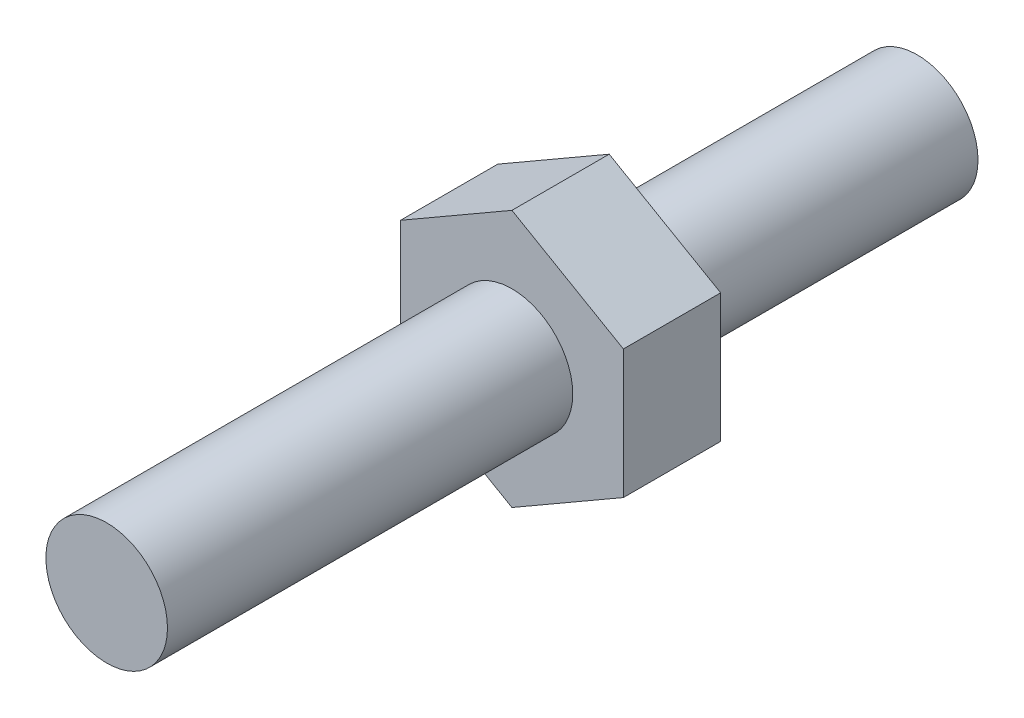
ISO-10303-21;
HEADER;
FILE_DESCRIPTION(('STEP AP214'),'2;1');
FILE_NAME('part.step','',(''),(''),'','','');
FILE_SCHEMA(('AUTOMOTIVE_DESIGN { 1 0 10303 214 1 1 1 1 }'));
ENDSEC;
DATA;
#1=APPLICATION_CONTEXT('core data for automotive mechanical design processes');
#2=APPLICATION_PROTOCOL_DEFINITION('international standard','automotive_design',2000,#1);
#3=PRODUCT_CONTEXT('',#1,'mechanical');
#4=PRODUCT('Part','Part','',(#3));
#5=PRODUCT_RELATED_PRODUCT_CATEGORY('part','',(#4));
#6=PRODUCT_DEFINITION_FORMATION('','',#4);
#7=PRODUCT_DEFINITION_CONTEXT('part definition',#1,'design');
#8=PRODUCT_DEFINITION('design','',#6,#7);
#9=PRODUCT_DEFINITION_SHAPE('','',#8);
#10=(LENGTH_UNIT() NAMED_UNIT(*) SI_UNIT(.MILLI.,.METRE.));
#11=(NAMED_UNIT(*) PLANE_ANGLE_UNIT() SI_UNIT($,.RADIAN.));
#12=(NAMED_UNIT(*) SI_UNIT($,.STERADIAN.) SOLID_ANGLE_UNIT());
#13=UNCERTAINTY_MEASURE_WITH_UNIT(LENGTH_MEASURE(1.E-05),#10,'distance_accuracy_value','');
#14=(GEOMETRIC_REPRESENTATION_CONTEXT(3) GLOBAL_UNCERTAINTY_ASSIGNED_CONTEXT((#13)) GLOBAL_UNIT_ASSIGNED_CONTEXT((#10,
#11,#12)) REPRESENTATION_CONTEXT('',''));
#15=CARTESIAN_POINT('',(0.,0.,0.));
#16=DIRECTION('',(0.,0.,1.));
#17=DIRECTION('',(1.,0.,0.));
#18=AXIS2_PLACEMENT_3D('',#15,#16,#17);
#19=CARTESIAN_POINT('',(0.,0.,-10.));
#20=DIRECTION('',(0.,0.,1.));
#21=DIRECTION('',(1.,0.,0.));
#22=AXIS2_PLACEMENT_3D('',#19,#20,#21);
#23=CYLINDRICAL_SURFACE('',#22,1.5);
#24=CARTESIAN_POINT('',(0.,0.,-2.4));
#25=DIRECTION('',(0.,0.,-1.));
#26=DIRECTION('',(-1.,0.,0.));
#27=AXIS2_PLACEMENT_3D('',#24,#25,#26);
#28=CIRCLE('',#27,1.5);
#29=CARTESIAN_POINT('',(-1.5,0.,-2.4));
#30=VERTEX_POINT('',#29);
#31=EDGE_CURVE('E183',#30,#30,#28,.T.);
#32=ORIENTED_EDGE('',*,*,#31,.T.);
#33=EDGE_LOOP('',(#32));
#34=FACE_BOUND('',#33,.T.);
#35=CARTESIAN_POINT('',(0.,0.,-10.));
#36=DIRECTION('',(0.,0.,1.));
#37=DIRECTION('',(1.,0.,0.));
#38=AXIS2_PLACEMENT_3D('',#35,#36,#37);
#39=CIRCLE('',#38,1.5);
#40=CARTESIAN_POINT('',(1.5,0.,-10.));
#41=VERTEX_POINT('',#40);
#42=EDGE_CURVE('E180',#41,#41,#39,.T.);
#43=ORIENTED_EDGE('',*,*,#42,.T.);
#44=EDGE_LOOP('',(#43));
#45=FACE_BOUND('',#44,.T.);
#46=ADVANCED_FACE('F35',(#34,#45),#23,.T.);
#47=CARTESIAN_POINT('',(0.,0.,-10.));
#48=DIRECTION('',(0.,0.,1.));
#49=DIRECTION('',(1.,0.,0.));
#50=AXIS2_PLACEMENT_3D('',#47,#48,#49);
#51=PLANE('',#50);
#52=ORIENTED_EDGE('',*,*,#42,.F.);
#53=EDGE_LOOP('',(#52));
#54=FACE_BOUND('',#53,.T.);
#55=ADVANCED_FACE('F152',(#54),#51,.F.);
#56=CARTESIAN_POINT('',(0.,3.17542648054296,-2.4));
#57=DIRECTION('',(-0.500000000000008,0.866025403784434,0.));
#58=DIRECTION('',(-0.866025403784434,-0.500000000000008,0.));
#59=AXIS2_PLACEMENT_3D('',#56,#57,#58);
#60=PLANE('',#59);
#61=DIRECTION('',(-0.866025403784434,-0.500000000000008,0.));
#62=VECTOR('',#61,1.);
#63=CARTESIAN_POINT('',(0.,3.17542648054296,0.));
#64=LINE('',#63,#62);
#65=CARTESIAN_POINT('',(0.,3.17542648054296,0.));
#66=VERTEX_POINT('',#65);
#67=CARTESIAN_POINT('',(-2.75,1.58771324027145,0.));
#68=VERTEX_POINT('',#67);
#69=EDGE_CURVE('E121',#66,#68,#64,.T.);
#70=ORIENTED_EDGE('',*,*,#69,.F.);
#71=DIRECTION('',(0.,0.,1.));
#72=VECTOR('',#71,1.);
#73=CARTESIAN_POINT('',(0.,3.17542648054296,-2.4));
#74=LINE('',#73,#72);
#75=CARTESIAN_POINT('',(0.,3.17542648054296,-2.4));
#76=VERTEX_POINT('',#75);
#77=EDGE_CURVE('E11',#76,#66,#74,.T.);
#78=ORIENTED_EDGE('',*,*,#77,.F.);
#79=DIRECTION('',(-0.866025403784434,-0.500000000000008,0.));
#80=VECTOR('',#79,1.);
#81=CARTESIAN_POINT('',(0.,3.17542648054296,-2.4));
#82=LINE('',#81,#80);
#83=CARTESIAN_POINT('',(-2.75,1.58771324027145,-2.4));
#84=VERTEX_POINT('',#83);
#85=EDGE_CURVE('E136',#76,#84,#82,.T.);
#86=ORIENTED_EDGE('',*,*,#85,.T.);
#87=DIRECTION('',(0.,0.,1.));
#88=VECTOR('',#87,1.);
#89=CARTESIAN_POINT('',(-2.75,1.58771324027145,-2.4));
#90=LINE('',#89,#88);
#91=EDGE_CURVE('E39',#84,#68,#90,.T.);
#92=ORIENTED_EDGE('',*,*,#91,.T.);
#93=EDGE_LOOP('',(#70,#78,#86,#92));
#94=FACE_BOUND('',#93,.T.);
#95=ADVANCED_FACE('F37',(#94),#60,.T.);
#96=CARTESIAN_POINT('',(2.75,1.58771324027146,-2.4));
#97=DIRECTION('',(0.500000000000008,0.866025403784434,0.));
#98=DIRECTION('',(-0.866025403784434,0.500000000000008,0.));
#99=AXIS2_PLACEMENT_3D('',#96,#97,#98);
#100=PLANE('',#99);
#101=DIRECTION('',(-0.866025403784434,0.500000000000008,0.));
#102=VECTOR('',#101,1.);
#103=CARTESIAN_POINT('',(2.75,1.58771324027146,0.));
#104=LINE('',#103,#102);
#105=CARTESIAN_POINT('',(2.75,1.58771324027146,0.));
#106=VERTEX_POINT('',#105);
#107=EDGE_CURVE('E134',#106,#66,#104,.T.);
#108=ORIENTED_EDGE('',*,*,#107,.F.);
#109=DIRECTION('',(0.,0.,1.));
#110=VECTOR('',#109,1.);
#111=CARTESIAN_POINT('',(2.75,1.58771324027146,-2.4));
#112=LINE('',#111,#110);
#113=CARTESIAN_POINT('',(2.75,1.58771324027146,-2.4));
#114=VERTEX_POINT('',#113);
#115=EDGE_CURVE('E45',#114,#106,#112,.T.);
#116=ORIENTED_EDGE('',*,*,#115,.F.);
#117=DIRECTION('',(-0.866025403784434,0.500000000000008,0.));
#118=VECTOR('',#117,1.);
#119=CARTESIAN_POINT('',(2.75,1.58771324027146,-2.4));
#120=LINE('',#119,#118);
#121=EDGE_CURVE('E103',#114,#76,#120,.T.);
#122=ORIENTED_EDGE('',*,*,#121,.T.);
#123=ORIENTED_EDGE('',*,*,#77,.T.);
#124=EDGE_LOOP('',(#108,#116,#122,#123));
#125=FACE_BOUND('',#124,.T.);
#126=ADVANCED_FACE('F144',(#125),#100,.T.);
#127=CARTESIAN_POINT('',(2.75,1.58771324027146,-2.4));
#128=DIRECTION('',(-1.,0.,0.));
#129=DIRECTION('',(0.,0.,1.));
#130=AXIS2_PLACEMENT_3D('',#127,#128,#129);
#131=PLANE('',#130);
#132=DIRECTION('',(0.,-1.,0.));
#133=VECTOR('',#132,1.);
#134=CARTESIAN_POINT('',(2.75,1.58771324027146,0.));
#135=LINE('',#134,#133);
#136=CARTESIAN_POINT('',(2.75,-1.5877132402715,0.));
#137=VERTEX_POINT('',#136);
#138=EDGE_CURVE('E107',#106,#137,#135,.T.);
#139=ORIENTED_EDGE('',*,*,#138,.T.);
#140=DIRECTION('',(0.,0.,1.));
#141=VECTOR('',#140,1.);
#142=CARTESIAN_POINT('',(2.75,-1.5877132402715,-2.4));
#143=LINE('',#142,#141);
#144=CARTESIAN_POINT('',(2.75,-1.5877132402715,-2.4));
#145=VERTEX_POINT('',#144);
#146=EDGE_CURVE('E105',#145,#137,#143,.T.);
#147=ORIENTED_EDGE('',*,*,#146,.F.);
#148=DIRECTION('',(0.,-1.,0.));
#149=VECTOR('',#148,1.);
#150=CARTESIAN_POINT('',(2.75,1.58771324027146,-2.4));
#151=LINE('',#150,#149);
#152=EDGE_CURVE('E96',#114,#145,#151,.T.);
#153=ORIENTED_EDGE('',*,*,#152,.F.);
#154=ORIENTED_EDGE('',*,*,#115,.T.);
#155=EDGE_LOOP('',(#139,#147,#153,#154));
#156=FACE_BOUND('',#155,.T.);
#157=ADVANCED_FACE('F106',(#156),#131,.F.);
#158=CARTESIAN_POINT('',(0.,-3.175426480543,-2.4));
#159=DIRECTION('',(0.500000000000007,-0.866025403784435,0.));
#160=DIRECTION('',(0.866025403784435,0.500000000000007,0.));
#161=AXIS2_PLACEMENT_3D('',#158,#159,#160);
#162=PLANE('',#161);
#163=DIRECTION('',(0.866025403784435,0.500000000000007,0.));
#164=VECTOR('',#163,1.);
#165=CARTESIAN_POINT('',(0.,-3.175426480543,0.));
#166=LINE('',#165,#164);
#167=CARTESIAN_POINT('',(0.,-3.175426480543,0.));
#168=VERTEX_POINT('',#167);
#169=EDGE_CURVE('E131',#168,#137,#166,.T.);
#170=ORIENTED_EDGE('',*,*,#169,.F.);
#171=DIRECTION('',(0.,0.,1.));
#172=VECTOR('',#171,1.);
#173=CARTESIAN_POINT('',(0.,-3.175426480543,-2.4));
#174=LINE('',#173,#172);
#175=CARTESIAN_POINT('',(0.,-3.175426480543,-2.4));
#176=VERTEX_POINT('',#175);
#177=EDGE_CURVE('E111',#176,#168,#174,.T.);
#178=ORIENTED_EDGE('',*,*,#177,.F.);
#179=DIRECTION('',(0.866025403784435,0.500000000000007,0.));
#180=VECTOR('',#179,1.);
#181=CARTESIAN_POINT('',(0.,-3.175426480543,-2.4));
#182=LINE('',#181,#180);
#183=EDGE_CURVE('E101',#176,#145,#182,.T.);
#184=ORIENTED_EDGE('',*,*,#183,.T.);
#185=ORIENTED_EDGE('',*,*,#146,.T.);
#186=EDGE_LOOP('',(#170,#178,#184,#185));
#187=FACE_BOUND('',#186,.T.);
#188=ADVANCED_FACE('F113',(#187),#162,.T.);
#189=CARTESIAN_POINT('',(-2.75,-1.5877132402715,-2.4));
#190=DIRECTION('',(-0.500000000000006,-0.866025403784435,0.));
#191=DIRECTION('',(0.866025403784435,-0.500000000000006,0.));
#192=AXIS2_PLACEMENT_3D('',#189,#190,#191);
#193=PLANE('',#192);
#194=DIRECTION('',(0.866025403784435,-0.500000000000006,0.));
#195=VECTOR('',#194,1.);
#196=CARTESIAN_POINT('',(-2.75,-1.5877132402715,0.));
#197=LINE('',#196,#195);
#198=CARTESIAN_POINT('',(-2.75,-1.5877132402715,0.));
#199=VERTEX_POINT('',#198);
#200=EDGE_CURVE('E128',#199,#168,#197,.T.);
#201=ORIENTED_EDGE('',*,*,#200,.F.);
#202=DIRECTION('',(0.,0.,1.));
#203=VECTOR('',#202,1.);
#204=CARTESIAN_POINT('',(-2.75,-1.5877132402715,-2.4));
#205=LINE('',#204,#203);
#206=CARTESIAN_POINT('',(-2.75,-1.5877132402715,-2.4));
#207=VERTEX_POINT('',#206);
#208=EDGE_CURVE('E139',#207,#199,#205,.T.);
#209=ORIENTED_EDGE('',*,*,#208,.F.);
#210=DIRECTION('',(0.866025403784435,-0.500000000000006,0.));
#211=VECTOR('',#210,1.);
#212=CARTESIAN_POINT('',(-2.75,-1.5877132402715,-2.4));
#213=LINE('',#212,#211);
#214=EDGE_CURVE('E114',#207,#176,#213,.T.);
#215=ORIENTED_EDGE('',*,*,#214,.T.);
#216=ORIENTED_EDGE('',*,*,#177,.T.);
#217=EDGE_LOOP('',(#201,#209,#215,#216));
#218=FACE_BOUND('',#217,.T.);
#219=ADVANCED_FACE('F189',(#218),#193,.T.);
#220=CARTESIAN_POINT('',(-2.75,1.58771324027145,-2.4));
#221=DIRECTION('',(-1.,0.,0.));
#222=DIRECTION('',(0.,0.,1.));
#223=AXIS2_PLACEMENT_3D('',#220,#221,#222);
#224=PLANE('',#223);
#225=DIRECTION('',(0.,-1.,0.));
#226=VECTOR('',#225,1.);
#227=CARTESIAN_POINT('',(-2.75,1.58771324027145,0.));
#228=LINE('',#227,#226);
#229=EDGE_CURVE('E124',#68,#199,#228,.T.);
#230=ORIENTED_EDGE('',*,*,#229,.F.);
#231=ORIENTED_EDGE('',*,*,#91,.F.);
#232=DIRECTION('',(0.,-1.,0.));
#233=VECTOR('',#232,1.);
#234=CARTESIAN_POINT('',(-2.75,1.58771324027145,-2.4));
#235=LINE('',#234,#233);
#236=EDGE_CURVE('E116',#84,#207,#235,.T.);
#237=ORIENTED_EDGE('',*,*,#236,.T.);
#238=ORIENTED_EDGE('',*,*,#208,.T.);
#239=EDGE_LOOP('',(#230,#231,#237,#238));
#240=FACE_BOUND('',#239,.T.);
#241=ADVANCED_FACE('F141',(#240),#224,.T.);
#242=CARTESIAN_POINT('',(0.,3.17542648054296,-2.4));
#243=DIRECTION('',(0.,0.,-1.));
#244=DIRECTION('',(-1.,0.,0.));
#245=AXIS2_PLACEMENT_3D('',#242,#243,#244);
#246=PLANE('',#245);
#247=ORIENTED_EDGE('',*,*,#31,.F.);
#248=EDGE_LOOP('',(#247));
#249=FACE_BOUND('',#248,.T.);
#250=ORIENTED_EDGE('',*,*,#85,.F.);
#251=ORIENTED_EDGE('',*,*,#121,.F.);
#252=ORIENTED_EDGE('',*,*,#152,.T.);
#253=ORIENTED_EDGE('',*,*,#183,.F.);
#254=ORIENTED_EDGE('',*,*,#214,.F.);
#255=ORIENTED_EDGE('',*,*,#236,.F.);
#256=EDGE_LOOP('',(#250,#251,#252,#253,#254,#255));
#257=FACE_BOUND('',#256,.T.);
#258=ADVANCED_FACE('F98',(#249,#257),#246,.T.);
#259=CARTESIAN_POINT('',(0.,3.17542648054296,0.));
#260=DIRECTION('',(0.,0.,-1.));
#261=DIRECTION('',(-1.,0.,0.));
#262=AXIS2_PLACEMENT_3D('',#259,#260,#261);
#263=PLANE('',#262);
#264=CARTESIAN_POINT('',(0.,0.,0.));
#265=DIRECTION('',(0.,0.,1.));
#266=DIRECTION('',(1.,0.,0.));
#267=AXIS2_PLACEMENT_3D('',#264,#265,#266);
#268=CIRCLE('',#267,1.5);
#269=CARTESIAN_POINT('',(1.5,0.,0.));
#270=VERTEX_POINT('',#269);
#271=EDGE_CURVE('E125',#270,#270,#268,.T.);
#272=ORIENTED_EDGE('',*,*,#271,.F.);
#273=EDGE_LOOP('',(#272));
#274=FACE_BOUND('',#273,.T.);
#275=ORIENTED_EDGE('',*,*,#69,.T.);
#276=ORIENTED_EDGE('',*,*,#229,.T.);
#277=ORIENTED_EDGE('',*,*,#200,.T.);
#278=ORIENTED_EDGE('',*,*,#169,.T.);
#279=ORIENTED_EDGE('',*,*,#138,.F.);
#280=ORIENTED_EDGE('',*,*,#107,.T.);
#281=EDGE_LOOP('',(#275,#276,#277,#278,#279,#280));
#282=FACE_BOUND('',#281,.T.);
#283=ADVANCED_FACE('F143',(#274,#282),#263,.F.);
#284=CARTESIAN_POINT('',(0.,0.,10.));
#285=DIRECTION('',(0.,0.,1.));
#286=DIRECTION('',(1.,0.,0.));
#287=AXIS2_PLACEMENT_3D('',#284,#285,#286);
#288=PLANE('',#287);
#289=CARTESIAN_POINT('',(0.,0.,10.));
#290=DIRECTION('',(0.,0.,1.));
#291=DIRECTION('',(1.,0.,0.));
#292=AXIS2_PLACEMENT_3D('',#289,#290,#291);
#293=CIRCLE('',#292,1.5);
#294=CARTESIAN_POINT('',(1.5,0.,10.));
#295=VERTEX_POINT('',#294);
#296=EDGE_CURVE('E179',#295,#295,#293,.T.);
#297=ORIENTED_EDGE('',*,*,#296,.T.);
#298=EDGE_LOOP('',(#297));
#299=FACE_BOUND('',#298,.T.);
#300=ADVANCED_FACE('F167',(#299),#288,.T.);
#301=ORIENTED_EDGE('',*,*,#271,.T.);
#302=EDGE_LOOP('',(#301));
#303=FACE_BOUND('',#302,.T.);
#304=ORIENTED_EDGE('',*,*,#296,.F.);
#305=EDGE_LOOP('',(#304));
#306=FACE_BOUND('',#305,.T.);
#307=ADVANCED_FACE('F157',(#303,#306),#23,.T.);
#308=CLOSED_SHELL('',(#46,#55,#95,#126,#157,#188,#219,#241,#258,#283,#300,#307));
#309=MANIFOLD_SOLID_BREP('B2',#308);
#310=ADVANCED_BREP_SHAPE_REPRESENTATION('',(#18,#309),#14);
#311=SHAPE_DEFINITION_REPRESENTATION(#9,#310);
ENDSEC;
END-ISO-10303-21;
